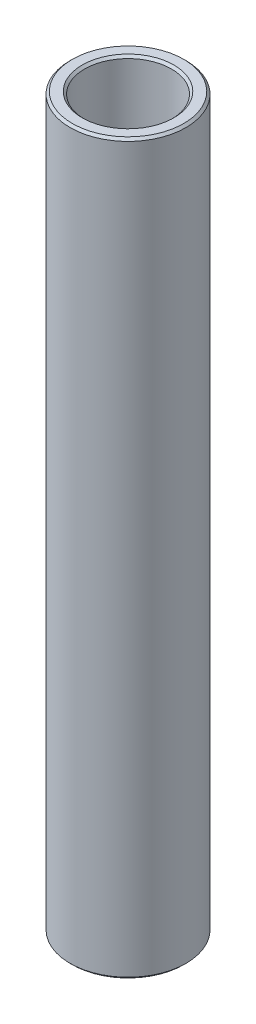
ISO-10303-21;
HEADER;
FILE_DESCRIPTION(('STEP AP214'),'2;1');
FILE_NAME('part.step','',(''),(''),'','','');
FILE_SCHEMA(('AUTOMOTIVE_DESIGN { 1 0 10303 214 1 1 1 1 }'));
ENDSEC;
DATA;
#1=APPLICATION_CONTEXT('core data for automotive mechanical design processes');
#2=APPLICATION_PROTOCOL_DEFINITION('international standard','automotive_design',2000,#1);
#3=PRODUCT_CONTEXT('',#1,'mechanical');
#4=PRODUCT('Part','Part','',(#3));
#5=PRODUCT_RELATED_PRODUCT_CATEGORY('part','',(#4));
#6=PRODUCT_DEFINITION_FORMATION('','',#4);
#7=PRODUCT_DEFINITION_CONTEXT('part definition',#1,'design');
#8=PRODUCT_DEFINITION('design','',#6,#7);
#9=PRODUCT_DEFINITION_SHAPE('','',#8);
#10=(LENGTH_UNIT() NAMED_UNIT(*) SI_UNIT(.MILLI.,.METRE.));
#11=(NAMED_UNIT(*) PLANE_ANGLE_UNIT() SI_UNIT($,.RADIAN.));
#12=(NAMED_UNIT(*) SI_UNIT($,.STERADIAN.) SOLID_ANGLE_UNIT());
#13=UNCERTAINTY_MEASURE_WITH_UNIT(LENGTH_MEASURE(1.E-05),#10,'distance_accuracy_value','');
#14=(GEOMETRIC_REPRESENTATION_CONTEXT(3) GLOBAL_UNCERTAINTY_ASSIGNED_CONTEXT((#13)) GLOBAL_UNIT_ASSIGNED_CONTEXT((#10,
#11,#12)) REPRESENTATION_CONTEXT('',''));
#15=CARTESIAN_POINT('',(0.,0.,0.));
#16=DIRECTION('',(0.,0.,1.));
#17=DIRECTION('',(1.,0.,0.));
#18=AXIS2_PLACEMENT_3D('',#15,#16,#17);
#19=CARTESIAN_POINT('',(6.35000000000029,70.6436949648142,0.));
#20=DIRECTION('',(0.,-1.,0.));
#21=DIRECTION('',(1.,0.,0.));
#22=AXIS2_PLACEMENT_3D('',#19,#20,#21);
#23=PLANE('',#22);
#24=CARTESIAN_POINT('',(0.,70.6436949648142,0.));
#25=DIRECTION('',(0.,-1.,0.));
#26=DIRECTION('',(1.,0.,0.));
#27=AXIS2_PLACEMENT_3D('',#24,#25,#26);
#28=CIRCLE('',#27,5.01650000000002);
#29=CARTESIAN_POINT('',(5.01650000000002,70.6436949648142,0.));
#30=VERTEX_POINT('',#29);
#31=EDGE_CURVE('E10',#30,#30,#28,.F.);
#32=ORIENTED_EDGE('',*,*,#31,.T.);
#33=EDGE_LOOP('',(#32));
#34=FACE_BOUND('',#33,.T.);
#35=CARTESIAN_POINT('',(0.,70.6436949648142,0.));
#36=DIRECTION('',(0.,-1.,0.));
#37=DIRECTION('',(1.,0.,0.));
#38=AXIS2_PLACEMENT_3D('',#35,#36,#37);
#39=CIRCLE('',#38,6.0960000000003);
#40=CARTESIAN_POINT('',(6.09600000000029,70.6436949648142,0.));
#41=VERTEX_POINT('',#40);
#42=EDGE_CURVE('E37',#41,#41,#39,.T.);
#43=ORIENTED_EDGE('',*,*,#42,.T.);
#44=EDGE_LOOP('',(#43));
#45=FACE_BOUND('',#44,.T.);
#46=ADVANCED_FACE('F30',(#34,#45),#23,.T.);
#47=CARTESIAN_POINT('',(0.,61.1186949648142,0.));
#48=DIRECTION('',(0.,-1.,0.));
#49=DIRECTION('',(1.,0.,0.));
#50=AXIS2_PLACEMENT_3D('',#47,#48,#49);
#51=CYLINDRICAL_SURFACE('',#50,4.76250000000003);
#52=CARTESIAN_POINT('',(0.,150.161569964812,0.));
#53=DIRECTION('',(0.,1.,0.));
#54=DIRECTION('',(-1.,0.,0.));
#55=AXIS2_PLACEMENT_3D('',#52,#53,#54);
#56=CIRCLE('',#55,4.76250000000003);
#57=CARTESIAN_POINT('',(-4.76250000000005,150.161569964812,0.));
#58=VERTEX_POINT('',#57);
#59=EDGE_CURVE('E41',#58,#58,#56,.T.);
#60=ORIENTED_EDGE('',*,*,#59,.T.);
#61=EDGE_LOOP('',(#60));
#62=FACE_BOUND('',#61,.T.);
#63=CARTESIAN_POINT('',(0.,70.8976949648141,0.));
#64=DIRECTION('',(0.,-1.,0.));
#65=DIRECTION('',(1.,0.,0.));
#66=AXIS2_PLACEMENT_3D('',#63,#64,#65);
#67=CIRCLE('',#66,4.76250000000003);
#68=CARTESIAN_POINT('',(4.76250000000002,70.8976949648141,0.));
#69=VERTEX_POINT('',#68);
#70=EDGE_CURVE('E45',#69,#69,#67,.T.);
#71=ORIENTED_EDGE('',*,*,#70,.T.);
#72=EDGE_LOOP('',(#71));
#73=FACE_BOUND('',#72,.T.);
#74=ADVANCED_FACE('F74',(#62,#73),#51,.F.);
#75=CARTESIAN_POINT('',(4.76250000000001,150.415569964812,0.));
#76=DIRECTION('',(0.,1.,0.));
#77=DIRECTION('',(-1.,0.,0.));
#78=AXIS2_PLACEMENT_3D('',#75,#76,#77);
#79=PLANE('',#78);
#80=CARTESIAN_POINT('',(0.,150.415569964812,0.));
#81=DIRECTION('',(0.,1.,0.));
#82=DIRECTION('',(-1.,0.,0.));
#83=AXIS2_PLACEMENT_3D('',#80,#81,#82);
#84=CIRCLE('',#83,6.09600000000033);
#85=CARTESIAN_POINT('',(-6.09600000000036,150.415569964812,0.));
#86=VERTEX_POINT('',#85);
#87=EDGE_CURVE('E50',#86,#86,#84,.T.);
#88=ORIENTED_EDGE('',*,*,#87,.T.);
#89=EDGE_LOOP('',(#88));
#90=FACE_BOUND('',#89,.T.);
#91=CARTESIAN_POINT('',(0.,150.415569964812,0.));
#92=DIRECTION('',(0.,1.,0.));
#93=DIRECTION('',(-1.,0.,0.));
#94=AXIS2_PLACEMENT_3D('',#91,#92,#93);
#95=CIRCLE('',#94,5.01650000000003);
#96=CARTESIAN_POINT('',(-5.01650000000006,150.415569964812,0.));
#97=VERTEX_POINT('',#96);
#98=EDGE_CURVE('E53',#97,#97,#95,.F.);
#99=ORIENTED_EDGE('',*,*,#98,.T.);
#100=EDGE_LOOP('',(#99));
#101=FACE_BOUND('',#100,.T.);
#102=ADVANCED_FACE('F79',(#90,#101),#79,.T.);
#103=CARTESIAN_POINT('',(0.,61.1186949648142,0.));
#104=DIRECTION('',(0.,-1.,0.));
#105=DIRECTION('',(1.,0.,0.));
#106=AXIS2_PLACEMENT_3D('',#103,#104,#105);
#107=CYLINDRICAL_SURFACE('',#106,6.3500000000003);
#108=CARTESIAN_POINT('',(0.,150.161569964812,0.));
#109=DIRECTION('',(0.,1.,0.));
#110=DIRECTION('',(-1.,0.,0.));
#111=AXIS2_PLACEMENT_3D('',#108,#109,#110);
#112=CIRCLE('',#111,6.3500000000003);
#113=CARTESIAN_POINT('',(-6.35000000000032,150.161569964812,0.));
#114=VERTEX_POINT('',#113);
#115=EDGE_CURVE('E56',#114,#114,#112,.F.);
#116=ORIENTED_EDGE('',*,*,#115,.T.);
#117=EDGE_LOOP('',(#116));
#118=FACE_BOUND('',#117,.T.);
#119=CARTESIAN_POINT('',(0.,70.8976949648142,0.));
#120=DIRECTION('',(0.,-1.,0.));
#121=DIRECTION('',(1.,0.,0.));
#122=AXIS2_PLACEMENT_3D('',#119,#120,#121);
#123=CIRCLE('',#122,6.3500000000003);
#124=CARTESIAN_POINT('',(6.3500000000003,70.8976949648142,0.));
#125=VERTEX_POINT('',#124);
#126=EDGE_CURVE('E59',#125,#125,#123,.F.);
#127=ORIENTED_EDGE('',*,*,#126,.T.);
#128=EDGE_LOOP('',(#127));
#129=FACE_BOUND('',#128,.T.);
#130=ADVANCED_FACE('F63',(#118,#129),#107,.T.);
#131=CARTESIAN_POINT('',(0.,150.161569964812,0.));
#132=DIRECTION('',(0.,-1.,0.));
#133=DIRECTION('',(1.,0.,0.));
#134=AXIS2_PLACEMENT_3D('',#131,#132,#133);
#135=CONICAL_SURFACE('',#134,6.3500000000003,0.785398163397435);
#136=ORIENTED_EDGE('',*,*,#87,.F.);
#137=EDGE_LOOP('',(#136));
#138=FACE_BOUND('',#137,.T.);
#139=ORIENTED_EDGE('',*,*,#115,.F.);
#140=EDGE_LOOP('',(#139));
#141=FACE_BOUND('',#140,.T.);
#142=ADVANCED_FACE('F84',(#138,#141),#135,.T.);
#143=CARTESIAN_POINT('',(0.,150.415569964812,0.));
#144=DIRECTION('',(0.,1.,0.));
#145=DIRECTION('',(-1.,0.,0.));
#146=AXIS2_PLACEMENT_3D('',#143,#144,#145);
#147=CONICAL_SURFACE('',#146,5.01650000000003,0.785398163397453);
#148=ORIENTED_EDGE('',*,*,#59,.F.);
#149=EDGE_LOOP('',(#148));
#150=FACE_BOUND('',#149,.T.);
#151=ORIENTED_EDGE('',*,*,#98,.F.);
#152=EDGE_LOOP('',(#151));
#153=FACE_BOUND('',#152,.T.);
#154=ADVANCED_FACE('F71',(#150,#153),#147,.F.);
#155=CARTESIAN_POINT('',(0.,70.8976949648141,0.));
#156=DIRECTION('',(0.,-1.,0.));
#157=DIRECTION('',(1.,0.,0.));
#158=AXIS2_PLACEMENT_3D('',#155,#156,#157);
#159=CONICAL_SURFACE('',#158,4.76250000000003,0.785398163397457);
#160=ORIENTED_EDGE('',*,*,#31,.F.);
#161=EDGE_LOOP('',(#160));
#162=FACE_BOUND('',#161,.T.);
#163=ORIENTED_EDGE('',*,*,#70,.F.);
#164=EDGE_LOOP('',(#163));
#165=FACE_BOUND('',#164,.T.);
#166=ADVANCED_FACE('F67',(#162,#165),#159,.F.);
#167=CARTESIAN_POINT('',(0.,70.6436949648142,0.));
#168=DIRECTION('',(0.,1.,0.));
#169=DIRECTION('',(-1.,0.,0.));
#170=AXIS2_PLACEMENT_3D('',#167,#168,#169);
#171=CONICAL_SURFACE('',#170,6.0960000000003,0.785398163397411);
#172=ORIENTED_EDGE('',*,*,#126,.F.);
#173=EDGE_LOOP('',(#172));
#174=FACE_BOUND('',#173,.T.);
#175=ORIENTED_EDGE('',*,*,#42,.F.);
#176=EDGE_LOOP('',(#175));
#177=FACE_BOUND('',#176,.T.);
#178=ADVANCED_FACE('F32',(#174,#177),#171,.T.);
#179=CLOSED_SHELL('',(#46,#74,#102,#130,#142,#154,#166,#178));
#180=MANIFOLD_SOLID_BREP('B2',#179);
#181=ADVANCED_BREP_SHAPE_REPRESENTATION('',(#18,#180),#14);
#182=SHAPE_DEFINITION_REPRESENTATION(#9,#181);
ENDSEC;
END-ISO-10303-21;
